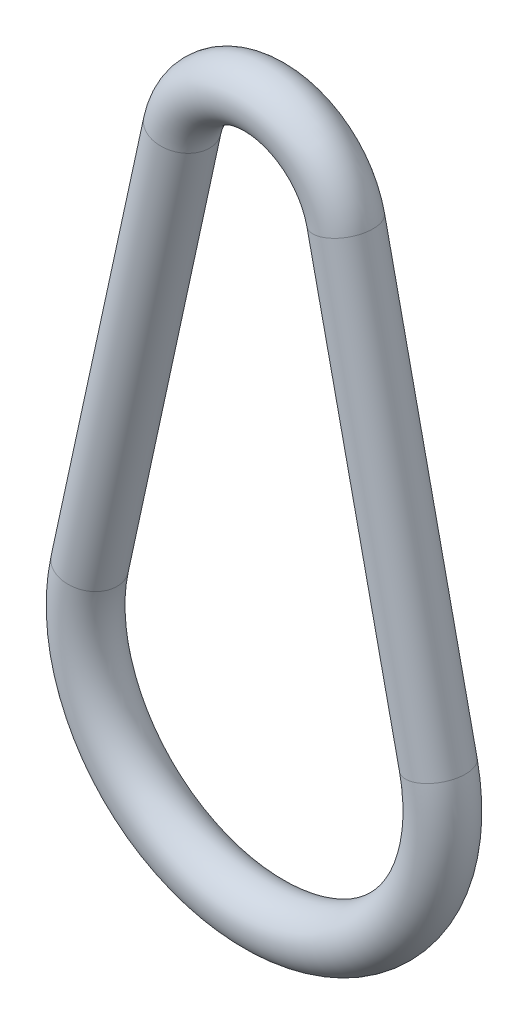
ISO-10303-21;
HEADER;
FILE_DESCRIPTION(('STEP AP214'),'2;1');
FILE_NAME('part.step','',(''),(''),'','','');
FILE_SCHEMA(('AUTOMOTIVE_DESIGN { 1 0 10303 214 1 1 1 1 }'));
ENDSEC;
DATA;
#1=APPLICATION_CONTEXT('core data for automotive mechanical design processes');
#2=APPLICATION_PROTOCOL_DEFINITION('international standard','automotive_design',2000,#1);
#3=PRODUCT_CONTEXT('',#1,'mechanical');
#4=PRODUCT('Part','Part','',(#3));
#5=PRODUCT_RELATED_PRODUCT_CATEGORY('part','',(#4));
#6=PRODUCT_DEFINITION_FORMATION('','',#4);
#7=PRODUCT_DEFINITION_CONTEXT('part definition',#1,'design');
#8=PRODUCT_DEFINITION('design','',#6,#7);
#9=PRODUCT_DEFINITION_SHAPE('','',#8);
#10=(LENGTH_UNIT() NAMED_UNIT(*) SI_UNIT(.MILLI.,.METRE.));
#11=(NAMED_UNIT(*) PLANE_ANGLE_UNIT() SI_UNIT($,.RADIAN.));
#12=(NAMED_UNIT(*) SI_UNIT($,.STERADIAN.) SOLID_ANGLE_UNIT());
#13=UNCERTAINTY_MEASURE_WITH_UNIT(LENGTH_MEASURE(1.E-05),#10,'distance_accuracy_value','');
#14=(GEOMETRIC_REPRESENTATION_CONTEXT(3) GLOBAL_UNCERTAINTY_ASSIGNED_CONTEXT((#13)) GLOBAL_UNIT_ASSIGNED_CONTEXT((#10,
#11,#12)) REPRESENTATION_CONTEXT('',''));
#15=CARTESIAN_POINT('',(0.,0.,0.));
#16=DIRECTION('',(0.,0.,1.));
#17=DIRECTION('',(1.,0.,0.));
#18=AXIS2_PLACEMENT_3D('',#15,#16,#17);
#19=CARTESIAN_POINT('',(-31.2691541299089,6.8,0.));
#20=DIRECTION('',(0.2125,0.977161066559654,0.));
#21=DIRECTION('',(-0.977161066559654,0.2125,0.));
#22=AXIS2_PLACEMENT_3D('',#19,#20,#21);
#23=CYLINDRICAL_SURFACE('',#22,5.);
#24=CARTESIAN_POINT('',(-14.6574159983948,83.1875,0.));
#25=DIRECTION('',(-0.2125,-0.977161066559654,0.));
#26=DIRECTION('',(0.977161066559654,-0.2125,0.));
#27=AXIS2_PLACEMENT_3D('',#24,#25,#26);
#28=CIRCLE('',#27,5.);
#29=CARTESIAN_POINT('',(-19.5432213311931,84.25,0.));
#30=VERTEX_POINT('',#29);
#31=EDGE_CURVE('E54',#30,#30,#28,.T.);
#32=ORIENTED_EDGE('',*,*,#31,.T.);
#33=EDGE_LOOP('',(#32));
#34=FACE_BOUND('',#33,.T.);
#35=CARTESIAN_POINT('',(-31.2691541299089,6.8,0.));
#36=DIRECTION('',(-0.2125,-0.977161066559654,0.));
#37=DIRECTION('',(0.977161066559654,-0.2125,0.));
#38=AXIS2_PLACEMENT_3D('',#35,#36,#37);
#39=CIRCLE('',#38,5.);
#40=CARTESIAN_POINT('',(-36.1549594627072,7.8625,0.));
#41=VERTEX_POINT('',#40);
#42=EDGE_CURVE('E59',#41,#41,#39,.T.);
#43=ORIENTED_EDGE('',*,*,#42,.F.);
#44=EDGE_LOOP('',(#43));
#45=FACE_BOUND('',#44,.T.);
#46=ADVANCED_FACE('F41',(#34,#45),#23,.T.);
#47=CARTESIAN_POINT('',(0.,80.,0.));
#48=DIRECTION('',(0.,0.,-1.));
#49=DIRECTION('',(-1.,0.,0.));
#50=AXIS2_PLACEMENT_3D('',#47,#48,#49);
#51=TOROIDAL_SURFACE('',#50,15.,5.);
#52=CARTESIAN_POINT('',(14.6574159983948,83.1875,0.));
#53=DIRECTION('',(-0.2125,0.977161066559654,0.));
#54=DIRECTION('',(-0.977161066559654,-0.2125,0.));
#55=AXIS2_PLACEMENT_3D('',#52,#53,#54);
#56=CIRCLE('',#55,5.);
#57=CARTESIAN_POINT('',(19.5432213311931,84.25,0.));
#58=VERTEX_POINT('',#57);
#59=EDGE_CURVE('E49',#58,#58,#56,.T.);
#60=CARTESIAN_POINT('',(0.,80.,0.));
#61=DIRECTION('',(0.,0.,-1.));
#62=DIRECTION('',(-1.,0.,0.));
#63=AXIS2_PLACEMENT_3D('',#60,#61,#62);
#64=CIRCLE('',#63,20.);
#65=EDGE_CURVE('',#30,#58,#64,.T.);
#66=ORIENTED_EDGE('',*,*,#31,.F.);
#67=ORIENTED_EDGE('',*,*,#59,.T.);
#68=ORIENTED_EDGE('',*,*,#65,.T.);
#69=ORIENTED_EDGE('',*,*,#65,.F.);
#70=EDGE_LOOP('',(#66,#68,#67,#69));
#71=FACE_BOUND('',#70,.T.);
#72=ADVANCED_FACE('F69',(#71),#51,.T.);
#73=CARTESIAN_POINT('',(14.6574159983948,83.1875,0.));
#74=DIRECTION('',(0.2125,-0.977161066559654,0.));
#75=DIRECTION('',(0.977161066559654,0.2125,0.));
#76=AXIS2_PLACEMENT_3D('',#73,#74,#75);
#77=CYLINDRICAL_SURFACE('',#76,5.);
#78=CARTESIAN_POINT('',(31.2691541299089,6.80000000000001,0.));
#79=DIRECTION('',(-0.2125,0.977161066559654,0.));
#80=DIRECTION('',(-0.977161066559654,-0.2125,0.));
#81=AXIS2_PLACEMENT_3D('',#78,#79,#80);
#82=CIRCLE('',#81,5.);
#83=CARTESIAN_POINT('',(36.1549594627072,7.86250000000001,0.));
#84=VERTEX_POINT('',#83);
#85=EDGE_CURVE('E10',#84,#84,#82,.T.);
#86=ORIENTED_EDGE('',*,*,#85,.T.);
#87=EDGE_LOOP('',(#86));
#88=FACE_BOUND('',#87,.T.);
#89=ORIENTED_EDGE('',*,*,#59,.F.);
#90=EDGE_LOOP('',(#89));
#91=FACE_BOUND('',#90,.T.);
#92=ADVANCED_FACE('F75',(#88,#91),#77,.T.);
#93=CARTESIAN_POINT('',(0.,0.,0.));
#94=DIRECTION('',(0.,0.,-1.));
#95=DIRECTION('',(-1.,0.,0.));
#96=AXIS2_PLACEMENT_3D('',#93,#94,#95);
#97=TOROIDAL_SURFACE('',#96,32.,5.);
#98=CARTESIAN_POINT('',(0.,0.,0.));
#99=DIRECTION('',(0.,0.,-1.));
#100=DIRECTION('',(-1.,0.,0.));
#101=AXIS2_PLACEMENT_3D('',#98,#99,#100);
#102=CIRCLE('',#101,37.);
#103=EDGE_CURVE('',#84,#41,#102,.T.);
#104=ORIENTED_EDGE('',*,*,#85,.F.);
#105=ORIENTED_EDGE('',*,*,#42,.T.);
#106=ORIENTED_EDGE('',*,*,#103,.T.);
#107=ORIENTED_EDGE('',*,*,#103,.F.);
#108=EDGE_LOOP('',(#104,#106,#105,#107));
#109=FACE_BOUND('',#108,.T.);
#110=ADVANCED_FACE('F43',(#109),#97,.T.);
#111=CLOSED_SHELL('',(#46,#72,#92,#110));
#112=MANIFOLD_SOLID_BREP('B2',#111);
#113=ADVANCED_BREP_SHAPE_REPRESENTATION('',(#18,#112),#14);
#114=SHAPE_DEFINITION_REPRESENTATION(#9,#113);
ENDSEC;
END-ISO-10303-21;
